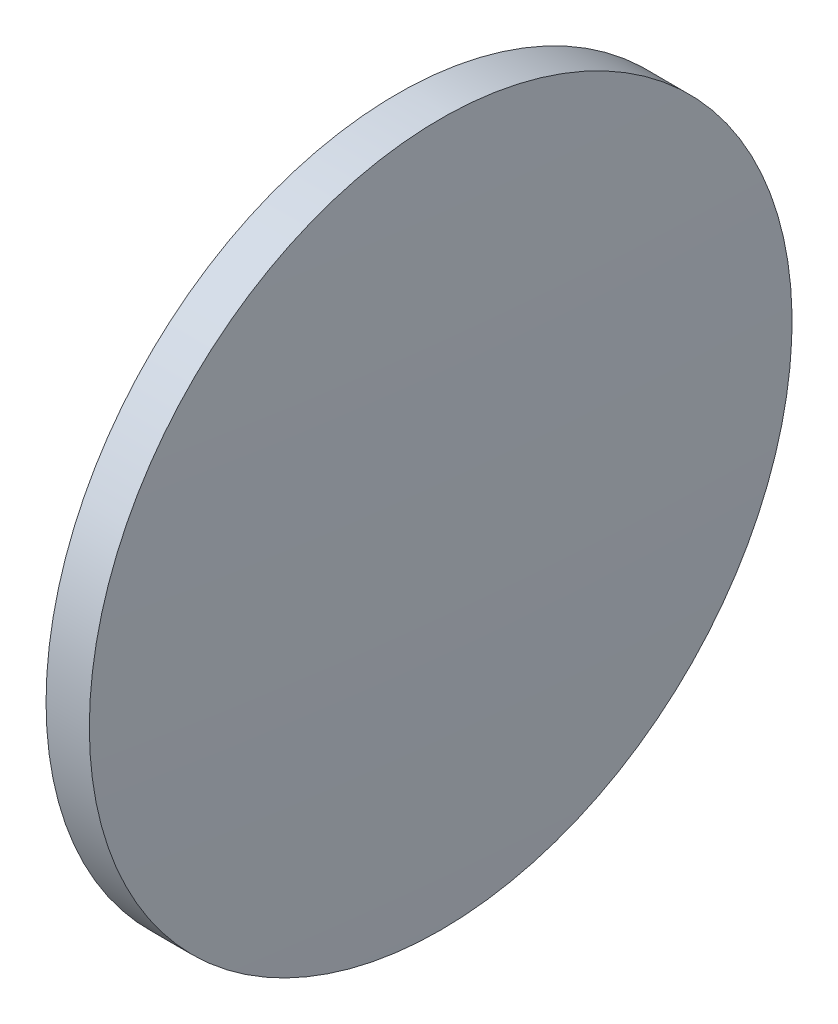
ISO-10303-21;
HEADER;
FILE_DESCRIPTION(('STEP AP214'),'2;1');
FILE_NAME('part.step','',(''),(''),'','','');
FILE_SCHEMA(('AUTOMOTIVE_DESIGN { 1 0 10303 214 1 1 1 1 }'));
ENDSEC;
DATA;
#1=APPLICATION_CONTEXT('core data for automotive mechanical design processes');
#2=APPLICATION_PROTOCOL_DEFINITION('international standard','automotive_design',2000,#1);
#3=PRODUCT_CONTEXT('',#1,'mechanical');
#4=PRODUCT('Part','Part','',(#3));
#5=PRODUCT_RELATED_PRODUCT_CATEGORY('part','',(#4));
#6=PRODUCT_DEFINITION_FORMATION('','',#4);
#7=PRODUCT_DEFINITION_CONTEXT('part definition',#1,'design');
#8=PRODUCT_DEFINITION('design','',#6,#7);
#9=PRODUCT_DEFINITION_SHAPE('','',#8);
#10=(LENGTH_UNIT() NAMED_UNIT(*) SI_UNIT(.MILLI.,.METRE.));
#11=(NAMED_UNIT(*) PLANE_ANGLE_UNIT() SI_UNIT($,.RADIAN.));
#12=(NAMED_UNIT(*) SI_UNIT($,.STERADIAN.) SOLID_ANGLE_UNIT());
#13=UNCERTAINTY_MEASURE_WITH_UNIT(LENGTH_MEASURE(1.E-05),#10,'distance_accuracy_value','');
#14=(GEOMETRIC_REPRESENTATION_CONTEXT(3) GLOBAL_UNCERTAINTY_ASSIGNED_CONTEXT((#13)) GLOBAL_UNIT_ASSIGNED_CONTEXT((#10,
#11,#12)) REPRESENTATION_CONTEXT('',''));
#15=CARTESIAN_POINT('',(0.,0.,0.));
#16=DIRECTION('',(0.,0.,1.));
#17=DIRECTION('',(1.,0.,0.));
#18=AXIS2_PLACEMENT_3D('',#15,#16,#17);
#19=CARTESIAN_POINT('',(59.065503071173,-40.4003403664583,0.));
#20=DIRECTION('',(-1.,0.,0.));
#21=DIRECTION('',(0.,-1.,0.));
#22=AXIS2_PLACEMENT_3D('',#19,#20,#21);
#23=SPHERICAL_SURFACE('',#22,325.64083333334);
#24=CARTESIAN_POINT('',(384.466336404513,-40.4003403664584,0.));
#25=DIRECTION('',(-1.,0.,0.));
#26=DIRECTION('',(0.,0.,1.));
#27=AXIS2_PLACEMENT_3D('',#24,#25,#26);
#28=CIRCLE('',#27,12.5);
#29=CARTESIAN_POINT('',(384.466336404513,-40.4003403664584,12.5));
#30=VERTEX_POINT('',#29);
#31=EDGE_CURVE('E10',#30,#30,#28,.T.);
#32=ORIENTED_EDGE('',*,*,#31,.F.);
#33=EDGE_LOOP('',(#32));
#34=FACE_BOUND('',#33,.T.);
#35=ADVANCED_FACE('F35',(#34),#23,.T.);
#36=CARTESIAN_POINT('',(380.897228826076,-40.4003403664584,0.));
#37=DIRECTION('',(-1.,0.,0.));
#38=DIRECTION('',(0.,0.,1.));
#39=AXIS2_PLACEMENT_3D('',#36,#37,#38);
#40=CYLINDRICAL_SURFACE('',#39,12.5);
#41=CARTESIAN_POINT('',(382.926336404513,-40.4003403664584,0.));
#42=DIRECTION('',(-1.,0.,0.));
#43=DIRECTION('',(0.,0.,1.));
#44=AXIS2_PLACEMENT_3D('',#41,#42,#43);
#45=CIRCLE('',#44,12.5);
#46=CARTESIAN_POINT('',(382.926336404513,-40.4003403664584,12.5));
#47=VERTEX_POINT('',#46);
#48=EDGE_CURVE('E41',#47,#47,#45,.T.);
#49=ORIENTED_EDGE('',*,*,#48,.F.);
#50=EDGE_LOOP('',(#49));
#51=FACE_BOUND('',#50,.T.);
#52=ORIENTED_EDGE('',*,*,#31,.T.);
#53=EDGE_LOOP('',(#52));
#54=FACE_BOUND('',#53,.T.);
#55=ADVANCED_FACE('F49',(#51,#54),#40,.T.);
#56=CARTESIAN_POINT('',(382.926336404513,-40.4003403664584,0.));
#57=DIRECTION('',(1.,0.,0.));
#58=DIRECTION('',(0.,0.,-1.));
#59=AXIS2_PLACEMENT_3D('',#56,#57,#58);
#60=PLANE('',#59);
#61=ORIENTED_EDGE('',*,*,#48,.T.);
#62=EDGE_LOOP('',(#61));
#63=FACE_BOUND('',#62,.T.);
#64=ADVANCED_FACE('F47',(#63),#60,.F.);
#65=CLOSED_SHELL('',(#35,#55,#64));
#66=MANIFOLD_SOLID_BREP('B2',#65);
#67=ADVANCED_BREP_SHAPE_REPRESENTATION('',(#18,#66),#14);
#68=SHAPE_DEFINITION_REPRESENTATION(#9,#67);
ENDSEC;
END-ISO-10303-21;
